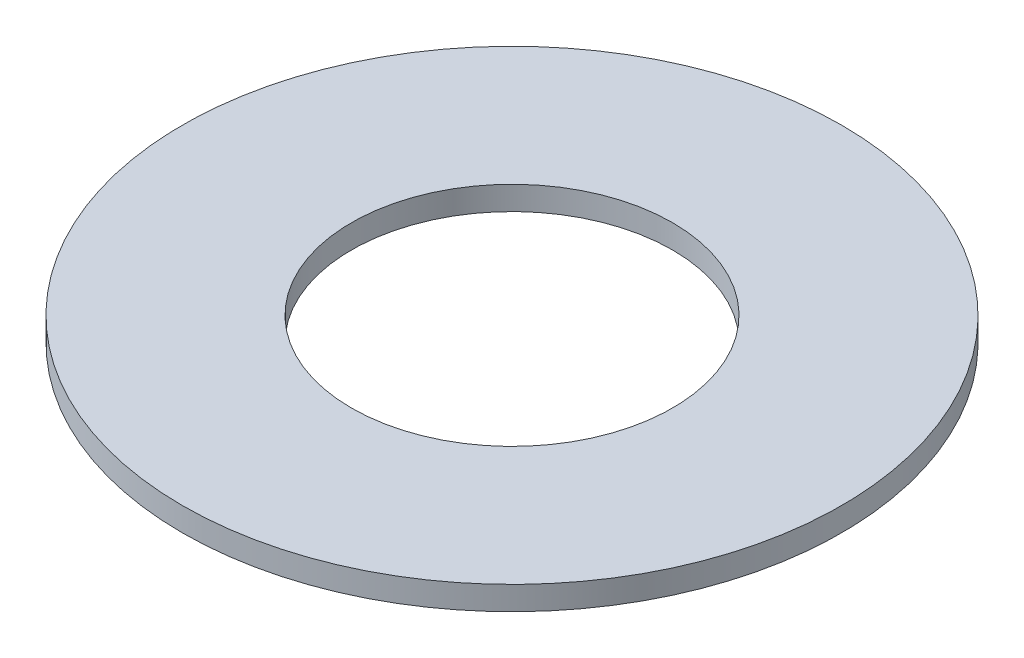
ISO-10303-21;
HEADER;
FILE_DESCRIPTION(('STEP AP214'),'2;1');
FILE_NAME('part.step','',(''),(''),'','','');
FILE_SCHEMA(('AUTOMOTIVE_DESIGN { 1 0 10303 214 1 1 1 1 }'));
ENDSEC;
DATA;
#1=APPLICATION_CONTEXT('core data for automotive mechanical design processes');
#2=APPLICATION_PROTOCOL_DEFINITION('international standard','automotive_design',2000,#1);
#3=PRODUCT_CONTEXT('',#1,'mechanical');
#4=PRODUCT('Part','Part','',(#3));
#5=PRODUCT_RELATED_PRODUCT_CATEGORY('part','',(#4));
#6=PRODUCT_DEFINITION_FORMATION('','',#4);
#7=PRODUCT_DEFINITION_CONTEXT('part definition',#1,'design');
#8=PRODUCT_DEFINITION('design','',#6,#7);
#9=PRODUCT_DEFINITION_SHAPE('','',#8);
#10=(LENGTH_UNIT() NAMED_UNIT(*) SI_UNIT(.MILLI.,.METRE.));
#11=(NAMED_UNIT(*) PLANE_ANGLE_UNIT() SI_UNIT($,.RADIAN.));
#12=(NAMED_UNIT(*) SI_UNIT($,.STERADIAN.) SOLID_ANGLE_UNIT());
#13=UNCERTAINTY_MEASURE_WITH_UNIT(LENGTH_MEASURE(1.E-05),#10,'distance_accuracy_value','');
#14=(GEOMETRIC_REPRESENTATION_CONTEXT(3) GLOBAL_UNCERTAINTY_ASSIGNED_CONTEXT((#13)) GLOBAL_UNIT_ASSIGNED_CONTEXT((#10,
#11,#12)) REPRESENTATION_CONTEXT('',''));
#15=CARTESIAN_POINT('',(0.,0.,0.));
#16=DIRECTION('',(0.,0.,1.));
#17=DIRECTION('',(1.,0.,0.));
#18=AXIS2_PLACEMENT_3D('',#15,#16,#17);
#19=CARTESIAN_POINT('',(0.,7.,0.));
#20=DIRECTION('',(0.,-1.,0.));
#21=DIRECTION('',(0.,0.,-1.));
#22=AXIS2_PLACEMENT_3D('',#19,#20,#21);
#23=CYLINDRICAL_SURFACE('',#22,97.5);
#24=CARTESIAN_POINT('',(0.,7.,0.));
#25=DIRECTION('',(0.,1.,0.));
#26=DIRECTION('',(0.,0.,1.));
#27=AXIS2_PLACEMENT_3D('',#24,#25,#26);
#28=CIRCLE('',#27,97.5);
#29=CARTESIAN_POINT('',(0.,7.,97.5));
#30=VERTEX_POINT('',#29);
#31=EDGE_CURVE('E10',#30,#30,#28,.T.);
#32=ORIENTED_EDGE('',*,*,#31,.F.);
#33=EDGE_LOOP('',(#32));
#34=FACE_BOUND('',#33,.T.);
#35=CARTESIAN_POINT('',(0.,0.,0.));
#36=DIRECTION('',(0.,1.,0.));
#37=DIRECTION('',(0.,0.,1.));
#38=AXIS2_PLACEMENT_3D('',#35,#36,#37);
#39=CIRCLE('',#38,97.5);
#40=CARTESIAN_POINT('',(0.,0.,97.5));
#41=VERTEX_POINT('',#40);
#42=EDGE_CURVE('E37',#41,#41,#39,.T.);
#43=ORIENTED_EDGE('',*,*,#42,.T.);
#44=EDGE_LOOP('',(#43));
#45=FACE_BOUND('',#44,.T.);
#46=ADVANCED_FACE('F40',(#34,#45),#23,.T.);
#47=CARTESIAN_POINT('',(0.,7.,0.));
#48=DIRECTION('',(0.,1.,0.));
#49=DIRECTION('',(0.,0.,1.));
#50=AXIS2_PLACEMENT_3D('',#47,#48,#49);
#51=PLANE('',#50);
#52=CARTESIAN_POINT('',(0.,7.,0.));
#53=DIRECTION('',(0.,1.,0.));
#54=DIRECTION('',(0.,0.,1.));
#55=AXIS2_PLACEMENT_3D('',#52,#53,#54);
#56=CIRCLE('',#55,47.5);
#57=CARTESIAN_POINT('',(0.,7.,47.5));
#58=VERTEX_POINT('',#57);
#59=EDGE_CURVE('E50',#58,#58,#56,.T.);
#60=ORIENTED_EDGE('',*,*,#59,.F.);
#61=EDGE_LOOP('',(#60));
#62=FACE_BOUND('',#61,.T.);
#63=ORIENTED_EDGE('',*,*,#31,.T.);
#64=EDGE_LOOP('',(#63));
#65=FACE_BOUND('',#64,.T.);
#66=ADVANCED_FACE('F59',(#62,#65),#51,.T.);
#67=CARTESIAN_POINT('',(0.,0.,0.));
#68=DIRECTION('',(0.,1.,0.));
#69=DIRECTION('',(0.,0.,1.));
#70=AXIS2_PLACEMENT_3D('',#67,#68,#69);
#71=PLANE('',#70);
#72=CARTESIAN_POINT('',(0.,0.,0.));
#73=DIRECTION('',(0.,1.,0.));
#74=DIRECTION('',(0.,0.,1.));
#75=AXIS2_PLACEMENT_3D('',#72,#73,#74);
#76=CIRCLE('',#75,47.5);
#77=CARTESIAN_POINT('',(0.,0.,47.5));
#78=VERTEX_POINT('',#77);
#79=EDGE_CURVE('E47',#78,#78,#76,.T.);
#80=ORIENTED_EDGE('',*,*,#79,.T.);
#81=EDGE_LOOP('',(#80));
#82=FACE_BOUND('',#81,.T.);
#83=ORIENTED_EDGE('',*,*,#42,.F.);
#84=EDGE_LOOP('',(#83));
#85=FACE_BOUND('',#84,.T.);
#86=ADVANCED_FACE('F58',(#82,#85),#71,.F.);
#87=CARTESIAN_POINT('',(0.,7.,0.));
#88=DIRECTION('',(0.,-1.,0.));
#89=DIRECTION('',(0.,0.,-1.));
#90=AXIS2_PLACEMENT_3D('',#87,#88,#89);
#91=CYLINDRICAL_SURFACE('',#90,47.5);
#92=ORIENTED_EDGE('',*,*,#59,.T.);
#93=EDGE_LOOP('',(#92));
#94=FACE_BOUND('',#93,.T.);
#95=ORIENTED_EDGE('',*,*,#79,.F.);
#96=EDGE_LOOP('',(#95));
#97=FACE_BOUND('',#96,.T.);
#98=ADVANCED_FACE('F54',(#94,#97),#91,.F.);
#99=CLOSED_SHELL('',(#46,#66,#86,#98));
#100=MANIFOLD_SOLID_BREP('B2',#99);
#101=ADVANCED_BREP_SHAPE_REPRESENTATION('',(#18,#100),#14);
#102=SHAPE_DEFINITION_REPRESENTATION(#9,#101);
ENDSEC;
END-ISO-10303-21;
